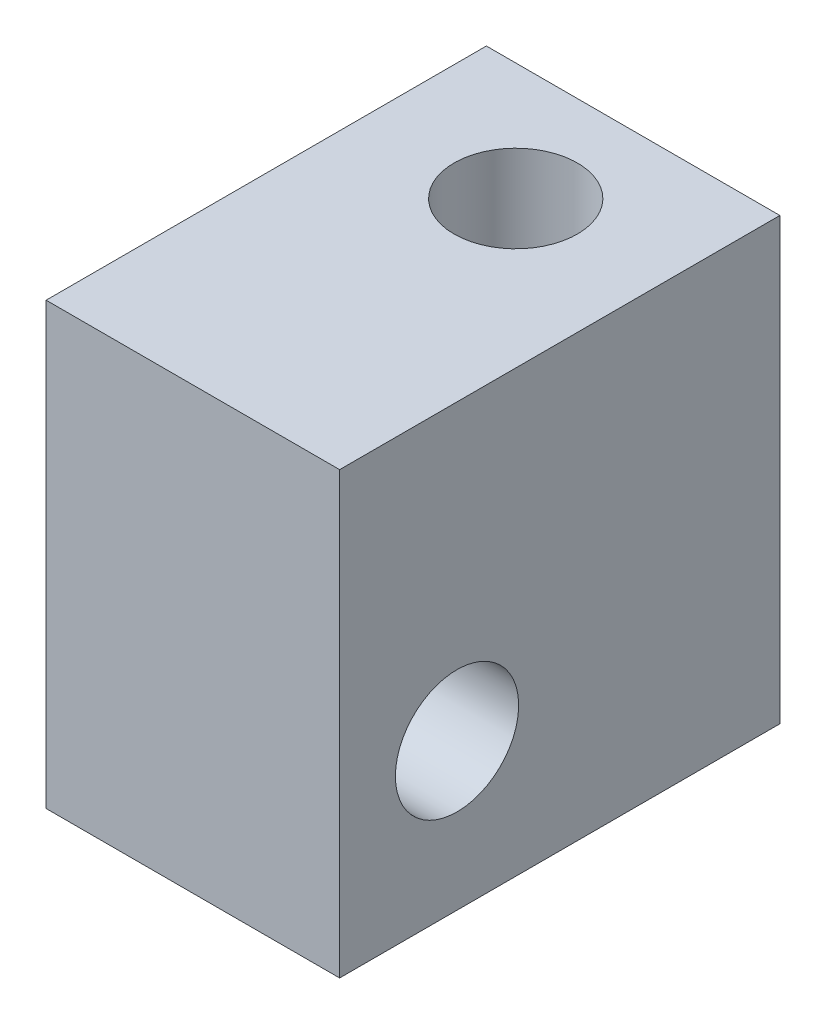
ISO-10303-21;
HEADER;
FILE_DESCRIPTION(('STEP AP214'),'2;1');
FILE_NAME('part.step','',(''),(''),'','','');
FILE_SCHEMA(('AUTOMOTIVE_DESIGN { 1 0 10303 214 1 1 1 1 }'));
ENDSEC;
DATA;
#1=APPLICATION_CONTEXT('core data for automotive mechanical design processes');
#2=APPLICATION_PROTOCOL_DEFINITION('international standard','automotive_design',2000,#1);
#3=PRODUCT_CONTEXT('',#1,'mechanical');
#4=PRODUCT('Part','Part','',(#3));
#5=PRODUCT_RELATED_PRODUCT_CATEGORY('part','',(#4));
#6=PRODUCT_DEFINITION_FORMATION('','',#4);
#7=PRODUCT_DEFINITION_CONTEXT('part definition',#1,'design');
#8=PRODUCT_DEFINITION('design','',#6,#7);
#9=PRODUCT_DEFINITION_SHAPE('','',#8);
#10=(LENGTH_UNIT() NAMED_UNIT(*) SI_UNIT(.MILLI.,.METRE.));
#11=(NAMED_UNIT(*) PLANE_ANGLE_UNIT() SI_UNIT($,.RADIAN.));
#12=(NAMED_UNIT(*) SI_UNIT($,.STERADIAN.) SOLID_ANGLE_UNIT());
#13=UNCERTAINTY_MEASURE_WITH_UNIT(LENGTH_MEASURE(1.E-05),#10,'distance_accuracy_value','');
#14=(GEOMETRIC_REPRESENTATION_CONTEXT(3) GLOBAL_UNCERTAINTY_ASSIGNED_CONTEXT((#13)) GLOBAL_UNIT_ASSIGNED_CONTEXT((#10,
#11,#12)) REPRESENTATION_CONTEXT('',''));
#15=CARTESIAN_POINT('',(0.,0.,0.));
#16=DIRECTION('',(0.,0.,1.));
#17=DIRECTION('',(1.,0.,0.));
#18=AXIS2_PLACEMENT_3D('',#15,#16,#17);
#19=CARTESIAN_POINT('',(5.,-7.5,15.));
#20=DIRECTION('',(-1.,0.,0.));
#21=DIRECTION('',(0.,0.,1.));
#22=AXIS2_PLACEMENT_3D('',#19,#20,#21);
#23=PLANE('',#22);
#24=CARTESIAN_POINT('',(5.,-2.5,11.));
#25=DIRECTION('',(-1.,0.,0.));
#26=DIRECTION('',(0.,0.,1.));
#27=AXIS2_PLACEMENT_3D('',#24,#25,#26);
#28=CIRCLE('',#27,2.1);
#29=CARTESIAN_POINT('',(5.,-2.5,13.1));
#30=VERTEX_POINT('',#29);
#31=EDGE_CURVE('E147',#30,#30,#28,.T.);
#32=ORIENTED_EDGE('',*,*,#31,.T.);
#33=EDGE_LOOP('',(#32));
#34=FACE_BOUND('',#33,.T.);
#35=DIRECTION('',(0.,1.,0.));
#36=VECTOR('',#35,1.);
#37=CARTESIAN_POINT('',(5.,-7.5,0.));
#38=LINE('',#37,#36);
#39=CARTESIAN_POINT('',(5.,-7.5,0.));
#40=VERTEX_POINT('',#39);
#41=CARTESIAN_POINT('',(5.,7.5,0.));
#42=VERTEX_POINT('',#41);
#43=EDGE_CURVE('E119',#40,#42,#38,.T.);
#44=ORIENTED_EDGE('',*,*,#43,.T.);
#45=DIRECTION('',(0.,0.,-1.));
#46=VECTOR('',#45,1.);
#47=CARTESIAN_POINT('',(5.,7.5,15.));
#48=LINE('',#47,#46);
#49=CARTESIAN_POINT('',(5.,7.5,15.));
#50=VERTEX_POINT('',#49);
#51=EDGE_CURVE('E11',#50,#42,#48,.T.);
#52=ORIENTED_EDGE('',*,*,#51,.F.);
#53=DIRECTION('',(0.,1.,0.));
#54=VECTOR('',#53,1.);
#55=CARTESIAN_POINT('',(5.,-7.5,15.));
#56=LINE('',#55,#54);
#57=CARTESIAN_POINT('',(5.,-7.5,15.));
#58=VERTEX_POINT('',#57);
#59=EDGE_CURVE('E103',#58,#50,#56,.T.);
#60=ORIENTED_EDGE('',*,*,#59,.F.);
#61=DIRECTION('',(0.,0.,-1.));
#62=VECTOR('',#61,1.);
#63=CARTESIAN_POINT('',(5.,-7.5,15.));
#64=LINE('',#63,#62);
#65=EDGE_CURVE('E115',#58,#40,#64,.T.);
#66=ORIENTED_EDGE('',*,*,#65,.T.);
#67=EDGE_LOOP('',(#44,#52,#60,#66));
#68=FACE_BOUND('',#67,.T.);
#69=ADVANCED_FACE('F49',(#34,#68),#23,.F.);
#70=CARTESIAN_POINT('',(-5.,7.5,15.));
#71=DIRECTION('',(0.,-1.,0.));
#72=DIRECTION('',(0.,0.,-1.));
#73=AXIS2_PLACEMENT_3D('',#70,#71,#72);
#74=PLANE('',#73);
#75=CARTESIAN_POINT('',(0.,7.5,4.));
#76=DIRECTION('',(0.,1.,0.));
#77=DIRECTION('',(0.,0.,1.));
#78=AXIS2_PLACEMENT_3D('',#75,#76,#77);
#79=CIRCLE('',#78,2.1);
#80=CARTESIAN_POINT('',(0.,7.5,6.1));
#81=VERTEX_POINT('',#80);
#82=EDGE_CURVE('E143',#81,#81,#79,.T.);
#83=ORIENTED_EDGE('',*,*,#82,.F.);
#84=EDGE_LOOP('',(#83));
#85=FACE_BOUND('',#84,.T.);
#86=DIRECTION('',(-1.,0.,0.));
#87=VECTOR('',#86,1.);
#88=CARTESIAN_POINT('',(-5.,7.5,0.));
#89=LINE('',#88,#87);
#90=CARTESIAN_POINT('',(-5.,7.5,0.));
#91=VERTEX_POINT('',#90);
#92=EDGE_CURVE('E108',#42,#91,#89,.T.);
#93=ORIENTED_EDGE('',*,*,#92,.T.);
#94=DIRECTION('',(0.,0.,-1.));
#95=VECTOR('',#94,1.);
#96=CARTESIAN_POINT('',(-5.,7.5,15.));
#97=LINE('',#96,#95);
#98=CARTESIAN_POINT('',(-5.,7.5,15.));
#99=VERTEX_POINT('',#98);
#100=EDGE_CURVE('E58',#99,#91,#97,.T.);
#101=ORIENTED_EDGE('',*,*,#100,.F.);
#102=DIRECTION('',(-1.,0.,0.));
#103=VECTOR('',#102,1.);
#104=CARTESIAN_POINT('',(-5.,7.5,15.));
#105=LINE('',#104,#103);
#106=EDGE_CURVE('E98',#50,#99,#105,.T.);
#107=ORIENTED_EDGE('',*,*,#106,.F.);
#108=ORIENTED_EDGE('',*,*,#51,.T.);
#109=EDGE_LOOP('',(#93,#101,#107,#108));
#110=FACE_BOUND('',#109,.T.);
#111=ADVANCED_FACE('F107',(#85,#110),#74,.F.);
#112=CARTESIAN_POINT('',(-5.,-7.5,15.));
#113=DIRECTION('',(1.,0.,0.));
#114=DIRECTION('',(0.,0.,-1.));
#115=AXIS2_PLACEMENT_3D('',#112,#113,#114);
#116=PLANE('',#115);
#117=CARTESIAN_POINT('',(-5.,-2.5,11.));
#118=DIRECTION('',(-1.,0.,0.));
#119=DIRECTION('',(0.,0.,1.));
#120=AXIS2_PLACEMENT_3D('',#117,#118,#119);
#121=CIRCLE('',#120,2.09999999999999);
#122=CARTESIAN_POINT('',(-5.,-2.5,13.1));
#123=VERTEX_POINT('',#122);
#124=EDGE_CURVE('E151',#123,#123,#121,.T.);
#125=ORIENTED_EDGE('',*,*,#124,.F.);
#126=EDGE_LOOP('',(#125));
#127=FACE_BOUND('',#126,.T.);
#128=DIRECTION('',(0.,-1.,0.));
#129=VECTOR('',#128,1.);
#130=CARTESIAN_POINT('',(-5.,-7.5,0.));
#131=LINE('',#130,#129);
#132=CARTESIAN_POINT('',(-5.,-7.5,0.));
#133=VERTEX_POINT('',#132);
#134=EDGE_CURVE('E84',#91,#133,#131,.T.);
#135=ORIENTED_EDGE('',*,*,#134,.T.);
#136=DIRECTION('',(0.,0.,-1.));
#137=VECTOR('',#136,1.);
#138=CARTESIAN_POINT('',(-5.,-7.5,15.));
#139=LINE('',#138,#137);
#140=CARTESIAN_POINT('',(-5.,-7.5,15.));
#141=VERTEX_POINT('',#140);
#142=EDGE_CURVE('E110',#141,#133,#139,.T.);
#143=ORIENTED_EDGE('',*,*,#142,.F.);
#144=DIRECTION('',(0.,-1.,0.));
#145=VECTOR('',#144,1.);
#146=CARTESIAN_POINT('',(-5.,-7.5,15.));
#147=LINE('',#146,#145);
#148=EDGE_CURVE('E101',#99,#141,#147,.T.);
#149=ORIENTED_EDGE('',*,*,#148,.F.);
#150=ORIENTED_EDGE('',*,*,#100,.T.);
#151=EDGE_LOOP('',(#135,#143,#149,#150));
#152=FACE_BOUND('',#151,.T.);
#153=ADVANCED_FACE('F111',(#127,#152),#116,.F.);
#154=CARTESIAN_POINT('',(-5.,-7.5,15.));
#155=DIRECTION('',(0.,1.,0.));
#156=DIRECTION('',(0.,0.,1.));
#157=AXIS2_PLACEMENT_3D('',#154,#155,#156);
#158=PLANE('',#157);
#159=CARTESIAN_POINT('',(0.,-7.5,4.));
#160=DIRECTION('',(0.,1.,0.));
#161=DIRECTION('',(0.,0.,1.));
#162=AXIS2_PLACEMENT_3D('',#159,#160,#161);
#163=CIRCLE('',#162,2.1);
#164=CARTESIAN_POINT('',(0.,-7.5,6.1));
#165=VERTEX_POINT('',#164);
#166=EDGE_CURVE('E123',#165,#165,#163,.T.);
#167=ORIENTED_EDGE('',*,*,#166,.T.);
#168=EDGE_LOOP('',(#167));
#169=FACE_BOUND('',#168,.T.);
#170=DIRECTION('',(1.,0.,0.));
#171=VECTOR('',#170,1.);
#172=CARTESIAN_POINT('',(-5.,-7.5,0.));
#173=LINE('',#172,#171);
#174=EDGE_CURVE('E90',#133,#40,#173,.T.);
#175=ORIENTED_EDGE('',*,*,#174,.T.);
#176=ORIENTED_EDGE('',*,*,#65,.F.);
#177=DIRECTION('',(1.,0.,0.));
#178=VECTOR('',#177,1.);
#179=CARTESIAN_POINT('',(-5.,-7.5,15.));
#180=LINE('',#179,#178);
#181=EDGE_CURVE('E66',#141,#58,#180,.T.);
#182=ORIENTED_EDGE('',*,*,#181,.F.);
#183=ORIENTED_EDGE('',*,*,#142,.T.);
#184=EDGE_LOOP('',(#175,#176,#182,#183));
#185=FACE_BOUND('',#184,.T.);
#186=ADVANCED_FACE('F133',(#169,#185),#158,.F.);
#187=CARTESIAN_POINT('',(0.,0.,15.));
#188=DIRECTION('',(0.,0.,-1.));
#189=DIRECTION('',(-1.,0.,0.));
#190=AXIS2_PLACEMENT_3D('',#187,#188,#189);
#191=PLANE('',#190);
#192=ORIENTED_EDGE('',*,*,#59,.T.);
#193=ORIENTED_EDGE('',*,*,#106,.T.);
#194=ORIENTED_EDGE('',*,*,#148,.T.);
#195=ORIENTED_EDGE('',*,*,#181,.T.);
#196=EDGE_LOOP('',(#192,#193,#194,#195));
#197=FACE_BOUND('',#196,.T.);
#198=ADVANCED_FACE('F99',(#197),#191,.F.);
#199=CARTESIAN_POINT('',(0.,0.,0.));
#200=DIRECTION('',(0.,0.,-1.));
#201=DIRECTION('',(-1.,0.,0.));
#202=AXIS2_PLACEMENT_3D('',#199,#200,#201);
#203=PLANE('',#202);
#204=ORIENTED_EDGE('',*,*,#43,.F.);
#205=ORIENTED_EDGE('',*,*,#174,.F.);
#206=ORIENTED_EDGE('',*,*,#134,.F.);
#207=ORIENTED_EDGE('',*,*,#92,.F.);
#208=EDGE_LOOP('',(#204,#205,#206,#207));
#209=FACE_BOUND('',#208,.T.);
#210=ADVANCED_FACE('F136',(#209),#203,.T.);
#211=CARTESIAN_POINT('',(0.,7.5,4.));
#212=DIRECTION('',(0.,1.,0.));
#213=DIRECTION('',(0.,0.,1.));
#214=AXIS2_PLACEMENT_3D('',#211,#212,#213);
#215=CYLINDRICAL_SURFACE('',#214,2.1);
#216=ORIENTED_EDGE('',*,*,#166,.F.);
#217=EDGE_LOOP('',(#216));
#218=FACE_BOUND('',#217,.T.);
#219=ORIENTED_EDGE('',*,*,#82,.T.);
#220=EDGE_LOOP('',(#219));
#221=FACE_BOUND('',#220,.T.);
#222=ADVANCED_FACE('F174',(#218,#221),#215,.F.);
#223=CARTESIAN_POINT('',(-5.,-2.5,11.));
#224=DIRECTION('',(-1.,0.,0.));
#225=DIRECTION('',(0.,0.,1.));
#226=AXIS2_PLACEMENT_3D('',#223,#224,#225);
#227=CYLINDRICAL_SURFACE('',#226,2.09999999999999);
#228=ORIENTED_EDGE('',*,*,#31,.F.);
#229=EDGE_LOOP('',(#228));
#230=FACE_BOUND('',#229,.T.);
#231=ORIENTED_EDGE('',*,*,#124,.T.);
#232=EDGE_LOOP('',(#231));
#233=FACE_BOUND('',#232,.T.);
#234=ADVANCED_FACE('F156',(#230,#233),#227,.F.);
#235=CLOSED_SHELL('',(#69,#111,#153,#186,#198,#210,#222,#234));
#236=MANIFOLD_SOLID_BREP('B2',#235);
#237=ADVANCED_BREP_SHAPE_REPRESENTATION('',(#18,#236),#14);
#238=SHAPE_DEFINITION_REPRESENTATION(#9,#237);
ENDSEC;
END-ISO-10303-21;
